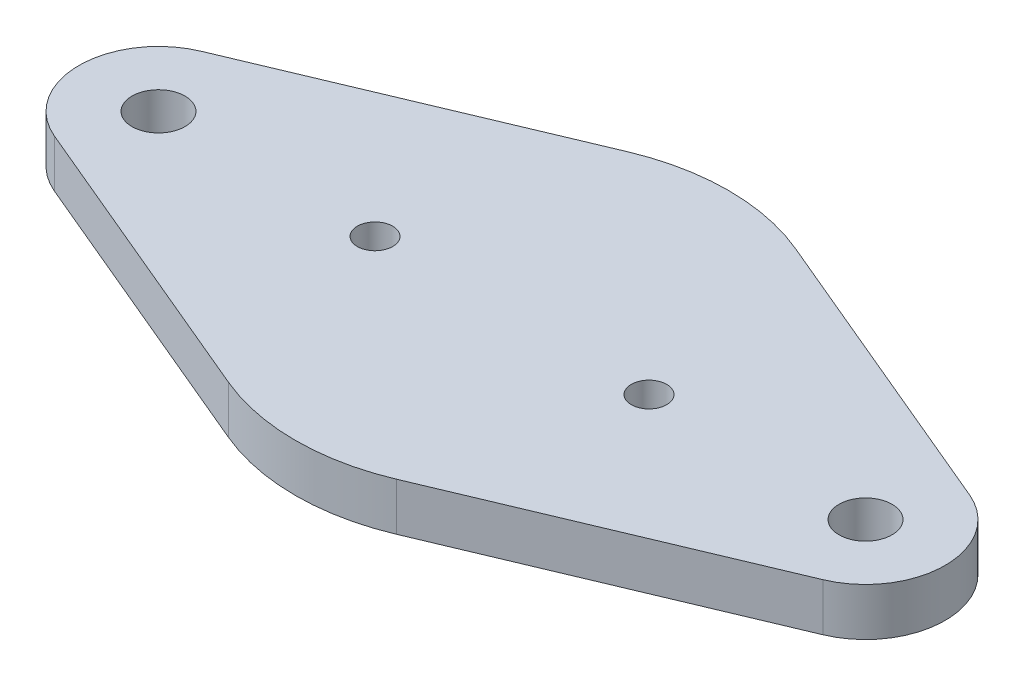
ISO-10303-21;
HEADER;
FILE_DESCRIPTION(('STEP AP214'),'2;1');
FILE_NAME('part.step','',(''),(''),'','','');
FILE_SCHEMA(('AUTOMOTIVE_DESIGN { 1 0 10303 214 1 1 1 1 }'));
ENDSEC;
DATA;
#1=APPLICATION_CONTEXT('core data for automotive mechanical design processes');
#2=APPLICATION_PROTOCOL_DEFINITION('international standard','automotive_design',2000,#1);
#3=PRODUCT_CONTEXT('',#1,'mechanical');
#4=PRODUCT('Part','Part','',(#3));
#5=PRODUCT_RELATED_PRODUCT_CATEGORY('part','',(#4));
#6=PRODUCT_DEFINITION_FORMATION('','',#4);
#7=PRODUCT_DEFINITION_CONTEXT('part definition',#1,'design');
#8=PRODUCT_DEFINITION('design','',#6,#7);
#9=PRODUCT_DEFINITION_SHAPE('','',#8);
#10=(LENGTH_UNIT() NAMED_UNIT(*) SI_UNIT(.MILLI.,.METRE.));
#11=(NAMED_UNIT(*) PLANE_ANGLE_UNIT() SI_UNIT($,.RADIAN.));
#12=(NAMED_UNIT(*) SI_UNIT($,.STERADIAN.) SOLID_ANGLE_UNIT());
#13=UNCERTAINTY_MEASURE_WITH_UNIT(LENGTH_MEASURE(1.E-05),#10,'distance_accuracy_value','');
#14=(GEOMETRIC_REPRESENTATION_CONTEXT(3) GLOBAL_UNCERTAINTY_ASSIGNED_CONTEXT((#13)) GLOBAL_UNIT_ASSIGNED_CONTEXT((#10,
#11,#12)) REPRESENTATION_CONTEXT('',''));
#15=CARTESIAN_POINT('',(0.,0.,0.));
#16=DIRECTION('',(0.,0.,1.));
#17=DIRECTION('',(1.,0.,0.));
#18=AXIS2_PLACEMENT_3D('',#15,#16,#17);
#19=CARTESIAN_POINT('',(0.,2.7,0.));
#20=DIRECTION('',(0.,-1.,0.));
#21=DIRECTION('',(0.,0.,-1.));
#22=AXIS2_PLACEMENT_3D('',#19,#20,#21);
#23=CYLINDRICAL_SURFACE('',#22,12.25);
#24=CARTESIAN_POINT('',(0.,0.,0.));
#25=DIRECTION('',(0.,1.,0.));
#26=DIRECTION('',(0.,0.,1.));
#27=AXIS2_PLACEMENT_3D('',#24,#25,#26);
#28=CIRCLE('',#27,12.25);
#29=CARTESIAN_POINT('',(4.746875,0.,-11.292903866339));
#30=VERTEX_POINT('',#29);
#31=CARTESIAN_POINT('',(-4.746875,0.,-11.292903866339));
#32=VERTEX_POINT('',#31);
#33=EDGE_CURVE('E128',#30,#32,#28,.T.);
#34=ORIENTED_EDGE('',*,*,#33,.T.);
#35=DIRECTION('',(0.,-1.,0.));
#36=VECTOR('',#35,1.);
#37=CARTESIAN_POINT('',(-4.746875,2.7,-11.292903866339));
#38=LINE('',#37,#36);
#39=CARTESIAN_POINT('',(-4.746875,2.7,-11.292903866339));
#40=VERTEX_POINT('',#39);
#41=EDGE_CURVE('E11',#40,#32,#38,.T.);
#42=ORIENTED_EDGE('',*,*,#41,.F.);
#43=CARTESIAN_POINT('',(0.,2.7,0.));
#44=DIRECTION('',(0.,1.,0.));
#45=DIRECTION('',(0.,0.,1.));
#46=AXIS2_PLACEMENT_3D('',#43,#44,#45);
#47=CIRCLE('',#46,12.25);
#48=CARTESIAN_POINT('',(4.746875,2.7,-11.292903866339));
#49=VERTEX_POINT('',#48);
#50=EDGE_CURVE('E143',#49,#40,#47,.T.);
#51=ORIENTED_EDGE('',*,*,#50,.F.);
#52=DIRECTION('',(0.,-1.,0.));
#53=VECTOR('',#52,1.);
#54=CARTESIAN_POINT('',(4.746875,2.7,-11.292903866339));
#55=LINE('',#54,#53);
#56=EDGE_CURVE('E124',#49,#30,#55,.T.);
#57=ORIENTED_EDGE('',*,*,#56,.T.);
#58=EDGE_LOOP('',(#34,#42,#51,#57));
#59=FACE_BOUND('',#58,.T.);
#60=ADVANCED_FACE('F32',(#59),#23,.T.);
#61=CARTESIAN_POINT('',(-4.746875,2.7,-11.292903866339));
#62=DIRECTION('',(0.3875,0.,0.921869703374615));
#63=DIRECTION('',(0.921869703374615,0.,-0.3875));
#64=AXIS2_PLACEMENT_3D('',#61,#62,#63);
#65=PLANE('',#64);
#66=DIRECTION('',(-0.921869703374615,0.,0.3875));
#67=VECTOR('',#66,1.);
#68=CARTESIAN_POINT('',(-4.746875,0.,-11.292903866339));
#69=LINE('',#68,#67);
#70=CARTESIAN_POINT('',(-21.74375,0.,-4.14841366518577));
#71=VERTEX_POINT('',#70);
#72=EDGE_CURVE('E131',#32,#71,#69,.T.);
#73=ORIENTED_EDGE('',*,*,#72,.T.);
#74=DIRECTION('',(0.,-1.,0.));
#75=VECTOR('',#74,1.);
#76=CARTESIAN_POINT('',(-21.74375,2.7,-4.14841366518577));
#77=LINE('',#76,#75);
#78=CARTESIAN_POINT('',(-21.74375,2.7,-4.14841366518577));
#79=VERTEX_POINT('',#78);
#80=EDGE_CURVE('E40',#79,#71,#77,.T.);
#81=ORIENTED_EDGE('',*,*,#80,.F.);
#82=DIRECTION('',(-0.921869703374615,0.,0.3875));
#83=VECTOR('',#82,1.);
#84=CARTESIAN_POINT('',(-4.746875,2.7,-11.292903866339));
#85=LINE('',#84,#83);
#86=EDGE_CURVE('E91',#40,#79,#85,.T.);
#87=ORIENTED_EDGE('',*,*,#86,.F.);
#88=ORIENTED_EDGE('',*,*,#41,.T.);
#89=EDGE_LOOP('',(#73,#81,#87,#88));
#90=FACE_BOUND('',#89,.T.);
#91=ADVANCED_FACE('F229',(#90),#65,.F.);
#92=CARTESIAN_POINT('',(-20.,2.7,0.));
#93=DIRECTION('',(0.,-1.,0.));
#94=DIRECTION('',(0.,0.,-1.));
#95=AXIS2_PLACEMENT_3D('',#92,#93,#94);
#96=CYLINDRICAL_SURFACE('',#95,4.5);
#97=CARTESIAN_POINT('',(-20.,0.,0.));
#98=DIRECTION('',(0.,1.,0.));
#99=DIRECTION('',(0.,0.,1.));
#100=AXIS2_PLACEMENT_3D('',#97,#98,#99);
#101=CIRCLE('',#100,4.5);
#102=CARTESIAN_POINT('',(-21.74375,0.,4.14841366518577));
#103=VERTEX_POINT('',#102);
#104=EDGE_CURVE('E134',#71,#103,#101,.T.);
#105=ORIENTED_EDGE('',*,*,#104,.T.);
#106=DIRECTION('',(0.,-1.,0.));
#107=VECTOR('',#106,1.);
#108=CARTESIAN_POINT('',(-21.74375,2.7,4.14841366518577));
#109=LINE('',#108,#107);
#110=CARTESIAN_POINT('',(-21.74375,2.7,4.14841366518577));
#111=VERTEX_POINT('',#110);
#112=EDGE_CURVE('E150',#111,#103,#109,.T.);
#113=ORIENTED_EDGE('',*,*,#112,.F.);
#114=CARTESIAN_POINT('',(-20.,2.7,0.));
#115=DIRECTION('',(0.,1.,0.));
#116=DIRECTION('',(0.,0.,1.));
#117=AXIS2_PLACEMENT_3D('',#114,#115,#116);
#118=CIRCLE('',#117,4.5);
#119=EDGE_CURVE('E158',#79,#111,#118,.T.);
#120=ORIENTED_EDGE('',*,*,#119,.F.);
#121=ORIENTED_EDGE('',*,*,#80,.T.);
#122=EDGE_LOOP('',(#105,#113,#120,#121));
#123=FACE_BOUND('',#122,.T.);
#124=ADVANCED_FACE('F156',(#123),#96,.T.);
#125=CARTESIAN_POINT('',(-21.74375,2.7,4.14841366518577));
#126=DIRECTION('',(0.3875,0.,-0.921869703374615));
#127=DIRECTION('',(-0.921869703374615,0.,-0.3875));
#128=AXIS2_PLACEMENT_3D('',#125,#126,#127);
#129=PLANE('',#128);
#130=DIRECTION('',(0.921869703374615,0.,0.3875));
#131=VECTOR('',#130,1.);
#132=CARTESIAN_POINT('',(-21.74375,0.,4.14841366518577));
#133=LINE('',#132,#131);
#134=CARTESIAN_POINT('',(-4.746875,0.,11.292903866339));
#135=VERTEX_POINT('',#134);
#136=EDGE_CURVE('E136',#103,#135,#133,.T.);
#137=ORIENTED_EDGE('',*,*,#136,.T.);
#138=DIRECTION('',(0.,-1.,0.));
#139=VECTOR('',#138,1.);
#140=CARTESIAN_POINT('',(-4.746875,2.7,11.292903866339));
#141=LINE('',#140,#139);
#142=CARTESIAN_POINT('',(-4.746875,2.7,11.292903866339));
#143=VERTEX_POINT('',#142);
#144=EDGE_CURVE('E147',#143,#135,#141,.T.);
#145=ORIENTED_EDGE('',*,*,#144,.F.);
#146=DIRECTION('',(0.921869703374615,0.,0.3875));
#147=VECTOR('',#146,1.);
#148=CARTESIAN_POINT('',(-21.74375,2.7,4.14841366518577));
#149=LINE('',#148,#147);
#150=EDGE_CURVE('E170',#111,#143,#149,.T.);
#151=ORIENTED_EDGE('',*,*,#150,.F.);
#152=ORIENTED_EDGE('',*,*,#112,.T.);
#153=EDGE_LOOP('',(#137,#145,#151,#152));
#154=FACE_BOUND('',#153,.T.);
#155=ADVANCED_FACE('F166',(#154),#129,.F.);
#156=CARTESIAN_POINT('',(0.,2.7,0.));
#157=DIRECTION('',(0.,-1.,0.));
#158=DIRECTION('',(0.,0.,-1.));
#159=AXIS2_PLACEMENT_3D('',#156,#157,#158);
#160=CYLINDRICAL_SURFACE('',#159,12.25);
#161=CARTESIAN_POINT('',(0.,0.,0.));
#162=DIRECTION('',(0.,1.,0.));
#163=DIRECTION('',(0.,0.,1.));
#164=AXIS2_PLACEMENT_3D('',#161,#162,#163);
#165=CIRCLE('',#164,12.25);
#166=CARTESIAN_POINT('',(4.746875,0.,11.292903866339));
#167=VERTEX_POINT('',#166);
#168=EDGE_CURVE('E138',#135,#167,#165,.T.);
#169=ORIENTED_EDGE('',*,*,#168,.T.);
#170=DIRECTION('',(0.,-1.,0.));
#171=VECTOR('',#170,1.);
#172=CARTESIAN_POINT('',(4.746875,2.7,11.292903866339));
#173=LINE('',#172,#171);
#174=CARTESIAN_POINT('',(4.746875,2.7,11.292903866339));
#175=VERTEX_POINT('',#174);
#176=EDGE_CURVE('E119',#175,#167,#173,.T.);
#177=ORIENTED_EDGE('',*,*,#176,.F.);
#178=CARTESIAN_POINT('',(0.,2.7,0.));
#179=DIRECTION('',(0.,1.,0.));
#180=DIRECTION('',(0.,0.,1.));
#181=AXIS2_PLACEMENT_3D('',#178,#179,#180);
#182=CIRCLE('',#181,12.25);
#183=EDGE_CURVE('E110',#143,#175,#182,.T.);
#184=ORIENTED_EDGE('',*,*,#183,.F.);
#185=ORIENTED_EDGE('',*,*,#144,.T.);
#186=EDGE_LOOP('',(#169,#177,#184,#185));
#187=FACE_BOUND('',#186,.T.);
#188=ADVANCED_FACE('F169',(#187),#160,.T.);
#189=CARTESIAN_POINT('',(21.74375,2.7,4.14841366518576));
#190=DIRECTION('',(-0.3875,0.,-0.921869703374615));
#191=DIRECTION('',(-0.921869703374615,0.,0.3875));
#192=AXIS2_PLACEMENT_3D('',#189,#190,#191);
#193=PLANE('',#192);
#194=DIRECTION('',(0.921869703374615,0.,-0.3875));
#195=VECTOR('',#194,1.);
#196=CARTESIAN_POINT('',(21.74375,0.,4.14841366518576));
#197=LINE('',#196,#195);
#198=CARTESIAN_POINT('',(21.74375,0.,4.14841366518577));
#199=VERTEX_POINT('',#198);
#200=EDGE_CURVE('E118',#167,#199,#197,.T.);
#201=ORIENTED_EDGE('',*,*,#200,.T.);
#202=DIRECTION('',(0.,-1.,0.));
#203=VECTOR('',#202,1.);
#204=CARTESIAN_POINT('',(21.74375,2.7,4.14841366518577));
#205=LINE('',#204,#203);
#206=CARTESIAN_POINT('',(21.74375,2.7,4.14841366518577));
#207=VERTEX_POINT('',#206);
#208=EDGE_CURVE('E115',#207,#199,#205,.T.);
#209=ORIENTED_EDGE('',*,*,#208,.F.);
#210=DIRECTION('',(0.921869703374615,0.,-0.3875));
#211=VECTOR('',#210,1.);
#212=CARTESIAN_POINT('',(21.74375,2.7,4.14841366518576));
#213=LINE('',#212,#211);
#214=EDGE_CURVE('E104',#175,#207,#213,.T.);
#215=ORIENTED_EDGE('',*,*,#214,.F.);
#216=ORIENTED_EDGE('',*,*,#176,.T.);
#217=EDGE_LOOP('',(#201,#209,#215,#216));
#218=FACE_BOUND('',#217,.T.);
#219=ADVANCED_FACE('F116',(#218),#193,.F.);
#220=CARTESIAN_POINT('',(20.,2.7,0.));
#221=DIRECTION('',(0.,-1.,0.));
#222=DIRECTION('',(0.,0.,-1.));
#223=AXIS2_PLACEMENT_3D('',#220,#221,#222);
#224=CYLINDRICAL_SURFACE('',#223,4.5);
#225=CARTESIAN_POINT('',(20.,0.,0.));
#226=DIRECTION('',(0.,1.,0.));
#227=DIRECTION('',(0.,0.,1.));
#228=AXIS2_PLACEMENT_3D('',#225,#226,#227);
#229=CIRCLE('',#228,4.5);
#230=CARTESIAN_POINT('',(21.74375,0.,-4.14841366518577));
#231=VERTEX_POINT('',#230);
#232=EDGE_CURVE('E77',#199,#231,#229,.T.);
#233=ORIENTED_EDGE('',*,*,#232,.T.);
#234=DIRECTION('',(0.,-1.,0.));
#235=VECTOR('',#234,1.);
#236=CARTESIAN_POINT('',(21.74375,2.7,-4.14841366518577));
#237=LINE('',#236,#235);
#238=CARTESIAN_POINT('',(21.74375,2.7,-4.14841366518577));
#239=VERTEX_POINT('',#238);
#240=EDGE_CURVE('E120',#239,#231,#237,.T.);
#241=ORIENTED_EDGE('',*,*,#240,.F.);
#242=CARTESIAN_POINT('',(20.,2.7,0.));
#243=DIRECTION('',(0.,1.,0.));
#244=DIRECTION('',(0.,0.,1.));
#245=AXIS2_PLACEMENT_3D('',#242,#243,#244);
#246=CIRCLE('',#245,4.5);
#247=EDGE_CURVE('E108',#207,#239,#246,.T.);
#248=ORIENTED_EDGE('',*,*,#247,.F.);
#249=ORIENTED_EDGE('',*,*,#208,.T.);
#250=EDGE_LOOP('',(#233,#241,#248,#249));
#251=FACE_BOUND('',#250,.T.);
#252=ADVANCED_FACE('F122',(#251),#224,.T.);
#253=CARTESIAN_POINT('',(4.746875,2.7,-11.292903866339));
#254=DIRECTION('',(-0.3875,0.,0.921869703374615));
#255=DIRECTION('',(0.921869703374615,0.,0.3875));
#256=AXIS2_PLACEMENT_3D('',#253,#254,#255);
#257=PLANE('',#256);
#258=DIRECTION('',(-0.921869703374615,0.,-0.3875));
#259=VECTOR('',#258,1.);
#260=CARTESIAN_POINT('',(4.746875,0.,-11.292903866339));
#261=LINE('',#260,#259);
#262=EDGE_CURVE('E83',#231,#30,#261,.T.);
#263=ORIENTED_EDGE('',*,*,#262,.T.);
#264=ORIENTED_EDGE('',*,*,#56,.F.);
#265=DIRECTION('',(-0.921869703374615,0.,-0.3875));
#266=VECTOR('',#265,1.);
#267=CARTESIAN_POINT('',(4.746875,2.7,-11.292903866339));
#268=LINE('',#267,#266);
#269=EDGE_CURVE('E48',#239,#49,#268,.T.);
#270=ORIENTED_EDGE('',*,*,#269,.F.);
#271=ORIENTED_EDGE('',*,*,#240,.T.);
#272=EDGE_LOOP('',(#263,#264,#270,#271));
#273=FACE_BOUND('',#272,.T.);
#274=ADVANCED_FACE('F205',(#273),#257,.F.);
#275=CARTESIAN_POINT('',(0.,2.7,0.));
#276=DIRECTION('',(0.,1.,0.));
#277=DIRECTION('',(0.,0.,1.));
#278=AXIS2_PLACEMENT_3D('',#275,#276,#277);
#279=PLANE('',#278);
#280=CARTESIAN_POINT('',(-7.75,2.7,0.));
#281=DIRECTION('',(0.,1.,0.));
#282=DIRECTION('',(0.,0.,1.));
#283=AXIS2_PLACEMENT_3D('',#280,#281,#282);
#284=CIRCLE('',#283,1.);
#285=CARTESIAN_POINT('',(-7.75,2.7,1.));
#286=VERTEX_POINT('',#285);
#287=EDGE_CURVE('E196',#286,#286,#284,.T.);
#288=ORIENTED_EDGE('',*,*,#287,.F.);
#289=EDGE_LOOP('',(#288));
#290=FACE_BOUND('',#289,.T.);
#291=CARTESIAN_POINT('',(7.75,2.7,0.));
#292=DIRECTION('',(0.,1.,0.));
#293=DIRECTION('',(0.,0.,1.));
#294=AXIS2_PLACEMENT_3D('',#291,#292,#293);
#295=CIRCLE('',#294,1.);
#296=CARTESIAN_POINT('',(7.75,2.7,1.));
#297=VERTEX_POINT('',#296);
#298=EDGE_CURVE('E190',#297,#297,#295,.T.);
#299=ORIENTED_EDGE('',*,*,#298,.F.);
#300=EDGE_LOOP('',(#299));
#301=FACE_BOUND('',#300,.T.);
#302=CARTESIAN_POINT('',(20.,2.7,0.));
#303=DIRECTION('',(0.,1.,0.));
#304=DIRECTION('',(0.,0.,1.));
#305=AXIS2_PLACEMENT_3D('',#302,#303,#304);
#306=CIRCLE('',#305,1.5);
#307=CARTESIAN_POINT('',(20.,2.7,1.5));
#308=VERTEX_POINT('',#307);
#309=EDGE_CURVE('E184',#308,#308,#306,.T.);
#310=ORIENTED_EDGE('',*,*,#309,.F.);
#311=EDGE_LOOP('',(#310));
#312=FACE_BOUND('',#311,.T.);
#313=CARTESIAN_POINT('',(-20.,2.7,0.));
#314=DIRECTION('',(0.,1.,0.));
#315=DIRECTION('',(0.,0.,1.));
#316=AXIS2_PLACEMENT_3D('',#313,#314,#315);
#317=CIRCLE('',#316,1.5);
#318=CARTESIAN_POINT('',(-20.,2.7,1.5));
#319=VERTEX_POINT('',#318);
#320=EDGE_CURVE('E178',#319,#319,#317,.T.);
#321=ORIENTED_EDGE('',*,*,#320,.F.);
#322=EDGE_LOOP('',(#321));
#323=FACE_BOUND('',#322,.T.);
#324=ORIENTED_EDGE('',*,*,#50,.T.);
#325=ORIENTED_EDGE('',*,*,#86,.T.);
#326=ORIENTED_EDGE('',*,*,#119,.T.);
#327=ORIENTED_EDGE('',*,*,#150,.T.);
#328=ORIENTED_EDGE('',*,*,#183,.T.);
#329=ORIENTED_EDGE('',*,*,#214,.T.);
#330=ORIENTED_EDGE('',*,*,#247,.T.);
#331=ORIENTED_EDGE('',*,*,#269,.T.);
#332=EDGE_LOOP('',(#324,#325,#326,#327,#328,#329,#330,#331));
#333=FACE_BOUND('',#332,.T.);
#334=ADVANCED_FACE('F106',(#290,#301,#312,#323,#333),#279,.T.);
#335=CARTESIAN_POINT('',(0.,0.,0.));
#336=DIRECTION('',(0.,1.,0.));
#337=DIRECTION('',(0.,0.,1.));
#338=AXIS2_PLACEMENT_3D('',#335,#336,#337);
#339=PLANE('',#338);
#340=CARTESIAN_POINT('',(-7.75,0.,0.));
#341=DIRECTION('',(0.,1.,0.));
#342=DIRECTION('',(0.,0.,1.));
#343=AXIS2_PLACEMENT_3D('',#340,#341,#342);
#344=CIRCLE('',#343,1.);
#345=CARTESIAN_POINT('',(-7.75,0.,1.));
#346=VERTEX_POINT('',#345);
#347=EDGE_CURVE('E193',#346,#346,#344,.F.);
#348=ORIENTED_EDGE('',*,*,#347,.F.);
#349=EDGE_LOOP('',(#348));
#350=FACE_BOUND('',#349,.T.);
#351=CARTESIAN_POINT('',(7.75,0.,0.));
#352=DIRECTION('',(0.,1.,0.));
#353=DIRECTION('',(0.,0.,1.));
#354=AXIS2_PLACEMENT_3D('',#351,#352,#353);
#355=CIRCLE('',#354,1.);
#356=CARTESIAN_POINT('',(7.75,0.,1.));
#357=VERTEX_POINT('',#356);
#358=EDGE_CURVE('E187',#357,#357,#355,.F.);
#359=ORIENTED_EDGE('',*,*,#358,.F.);
#360=EDGE_LOOP('',(#359));
#361=FACE_BOUND('',#360,.T.);
#362=CARTESIAN_POINT('',(20.,0.,0.));
#363=DIRECTION('',(0.,1.,0.));
#364=DIRECTION('',(0.,0.,1.));
#365=AXIS2_PLACEMENT_3D('',#362,#363,#364);
#366=CIRCLE('',#365,1.5);
#367=CARTESIAN_POINT('',(20.,0.,1.5));
#368=VERTEX_POINT('',#367);
#369=EDGE_CURVE('E181',#368,#368,#366,.F.);
#370=ORIENTED_EDGE('',*,*,#369,.F.);
#371=EDGE_LOOP('',(#370));
#372=FACE_BOUND('',#371,.T.);
#373=CARTESIAN_POINT('',(-20.,0.,0.));
#374=DIRECTION('',(0.,1.,0.));
#375=DIRECTION('',(0.,0.,1.));
#376=AXIS2_PLACEMENT_3D('',#373,#374,#375);
#377=CIRCLE('',#376,1.5);
#378=CARTESIAN_POINT('',(-20.,0.,1.5));
#379=VERTEX_POINT('',#378);
#380=EDGE_CURVE('E132',#379,#379,#377,.F.);
#381=ORIENTED_EDGE('',*,*,#380,.F.);
#382=EDGE_LOOP('',(#381));
#383=FACE_BOUND('',#382,.T.);
#384=ORIENTED_EDGE('',*,*,#33,.F.);
#385=ORIENTED_EDGE('',*,*,#262,.F.);
#386=ORIENTED_EDGE('',*,*,#232,.F.);
#387=ORIENTED_EDGE('',*,*,#200,.F.);
#388=ORIENTED_EDGE('',*,*,#168,.F.);
#389=ORIENTED_EDGE('',*,*,#136,.F.);
#390=ORIENTED_EDGE('',*,*,#104,.F.);
#391=ORIENTED_EDGE('',*,*,#72,.F.);
#392=EDGE_LOOP('',(#384,#385,#386,#387,#388,#389,#390,#391));
#393=FACE_BOUND('',#392,.T.);
#394=ADVANCED_FACE('F162',(#350,#361,#372,#383,#393),#339,.F.);
#395=CARTESIAN_POINT('',(-20.,-0.00100000000000013,0.));
#396=DIRECTION('',(0.,1.,0.));
#397=DIRECTION('',(0.,0.,1.));
#398=AXIS2_PLACEMENT_3D('',#395,#396,#397);
#399=CYLINDRICAL_SURFACE('',#398,1.5);
#400=ORIENTED_EDGE('',*,*,#320,.T.);
#401=EDGE_LOOP('',(#400));
#402=FACE_BOUND('',#401,.T.);
#403=ORIENTED_EDGE('',*,*,#380,.T.);
#404=EDGE_LOOP('',(#403));
#405=FACE_BOUND('',#404,.T.);
#406=ADVANCED_FACE('F213',(#402,#405),#399,.F.);
#407=CARTESIAN_POINT('',(20.,-0.00100000000000013,0.));
#408=DIRECTION('',(0.,1.,0.));
#409=DIRECTION('',(0.,0.,1.));
#410=AXIS2_PLACEMENT_3D('',#407,#408,#409);
#411=CYLINDRICAL_SURFACE('',#410,1.5);
#412=ORIENTED_EDGE('',*,*,#309,.T.);
#413=EDGE_LOOP('',(#412));
#414=FACE_BOUND('',#413,.T.);
#415=ORIENTED_EDGE('',*,*,#369,.T.);
#416=EDGE_LOOP('',(#415));
#417=FACE_BOUND('',#416,.T.);
#418=ADVANCED_FACE('F216',(#414,#417),#411,.F.);
#419=CARTESIAN_POINT('',(7.75,-0.00100000000000013,0.));
#420=DIRECTION('',(0.,1.,0.));
#421=DIRECTION('',(0.,0.,1.));
#422=AXIS2_PLACEMENT_3D('',#419,#420,#421);
#423=CYLINDRICAL_SURFACE('',#422,1.);
#424=ORIENTED_EDGE('',*,*,#298,.T.);
#425=EDGE_LOOP('',(#424));
#426=FACE_BOUND('',#425,.T.);
#427=ORIENTED_EDGE('',*,*,#358,.T.);
#428=EDGE_LOOP('',(#427));
#429=FACE_BOUND('',#428,.T.);
#430=ADVANCED_FACE('F298',(#426,#429),#423,.F.);
#431=CARTESIAN_POINT('',(-7.75,-0.00100000000000013,0.));
#432=DIRECTION('',(0.,1.,0.));
#433=DIRECTION('',(0.,0.,1.));
#434=AXIS2_PLACEMENT_3D('',#431,#432,#433);
#435=CYLINDRICAL_SURFACE('',#434,1.);
#436=ORIENTED_EDGE('',*,*,#287,.T.);
#437=EDGE_LOOP('',(#436));
#438=FACE_BOUND('',#437,.T.);
#439=ORIENTED_EDGE('',*,*,#347,.T.);
#440=EDGE_LOOP('',(#439));
#441=FACE_BOUND('',#440,.T.);
#442=ADVANCED_FACE('F200',(#438,#441),#435,.F.);
#443=CLOSED_SHELL('',(#60,#91,#124,#155,#188,#219,#252,#274,#334,#394,#406,#418,#430,#442));
#444=MANIFOLD_SOLID_BREP('B2',#443);
#445=ADVANCED_BREP_SHAPE_REPRESENTATION('',(#18,#444),#14);
#446=SHAPE_DEFINITION_REPRESENTATION(#9,#445);
ENDSEC;
END-ISO-10303-21;
